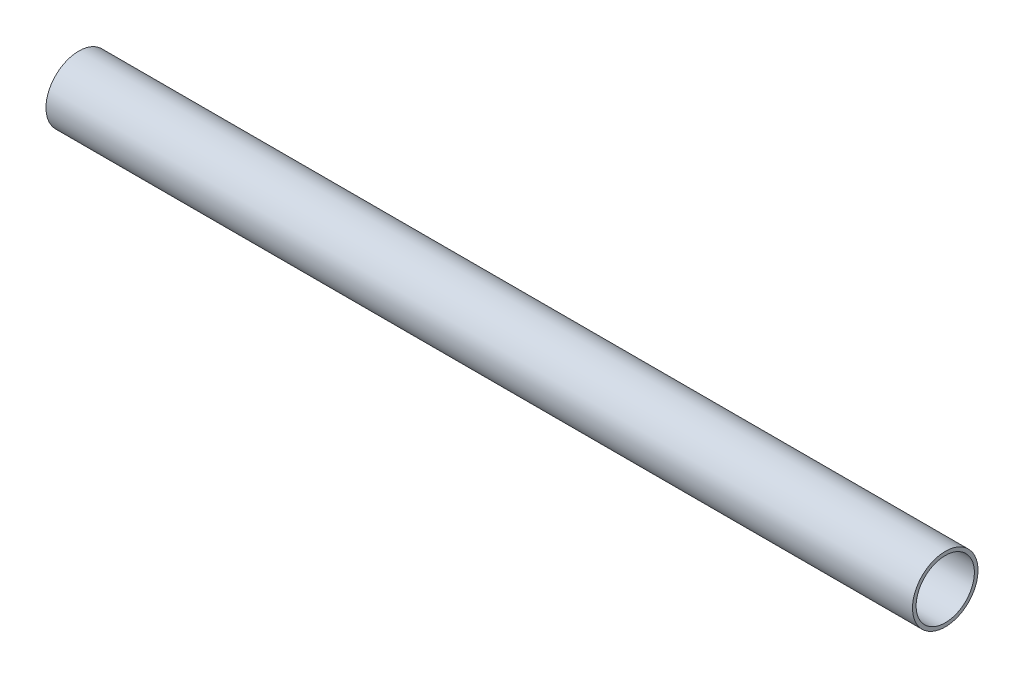
ISO-10303-21;
HEADER;
FILE_DESCRIPTION(('STEP AP214'),'2;1');
FILE_NAME('part.step','',(''),(''),'','','');
FILE_SCHEMA(('AUTOMOTIVE_DESIGN { 1 0 10303 214 1 1 1 1 }'));
ENDSEC;
DATA;
#1=APPLICATION_CONTEXT('core data for automotive mechanical design processes');
#2=APPLICATION_PROTOCOL_DEFINITION('international standard','automotive_design',2000,#1);
#3=PRODUCT_CONTEXT('',#1,'mechanical');
#4=PRODUCT('Part','Part','',(#3));
#5=PRODUCT_RELATED_PRODUCT_CATEGORY('part','',(#4));
#6=PRODUCT_DEFINITION_FORMATION('','',#4);
#7=PRODUCT_DEFINITION_CONTEXT('part definition',#1,'design');
#8=PRODUCT_DEFINITION('design','',#6,#7);
#9=PRODUCT_DEFINITION_SHAPE('','',#8);
#10=(LENGTH_UNIT() NAMED_UNIT(*) SI_UNIT(.MILLI.,.METRE.));
#11=(NAMED_UNIT(*) PLANE_ANGLE_UNIT() SI_UNIT($,.RADIAN.));
#12=(NAMED_UNIT(*) SI_UNIT($,.STERADIAN.) SOLID_ANGLE_UNIT());
#13=UNCERTAINTY_MEASURE_WITH_UNIT(LENGTH_MEASURE(1.E-05),#10,'distance_accuracy_value','');
#14=(GEOMETRIC_REPRESENTATION_CONTEXT(3) GLOBAL_UNCERTAINTY_ASSIGNED_CONTEXT((#13)) GLOBAL_UNIT_ASSIGNED_CONTEXT((#10,
#11,#12)) REPRESENTATION_CONTEXT('',''));
#15=CARTESIAN_POINT('',(0.,0.,0.));
#16=DIRECTION('',(0.,0.,1.));
#17=DIRECTION('',(1.,0.,0.));
#18=AXIS2_PLACEMENT_3D('',#15,#16,#17);
#19=CARTESIAN_POINT('',(400.183766184074,0.,0.));
#20=DIRECTION('',(-1.,0.,0.));
#21=DIRECTION('',(0.,0.,1.));
#22=AXIS2_PLACEMENT_3D('',#19,#20,#21);
#23=CYLINDRICAL_SURFACE('',#22,13.5);
#24=CARTESIAN_POINT('',(0.,0.,0.));
#25=DIRECTION('',(1.,0.,0.));
#26=DIRECTION('',(0.,0.,-1.));
#27=AXIS2_PLACEMENT_3D('',#24,#25,#26);
#28=CIRCLE('',#27,13.5);
#29=CARTESIAN_POINT('',(0.,0.,-13.5));
#30=VERTEX_POINT('',#29);
#31=EDGE_CURVE('E41',#30,#30,#28,.T.);
#32=ORIENTED_EDGE('',*,*,#31,.T.);
#33=EDGE_LOOP('',(#32));
#34=FACE_BOUND('',#33,.T.);
#35=CARTESIAN_POINT('',(357.,0.,0.));
#36=DIRECTION('',(1.,0.,0.));
#37=DIRECTION('',(0.,1.,0.));
#38=AXIS2_PLACEMENT_3D('',#35,#36,#37);
#39=CIRCLE('',#38,13.5);
#40=CARTESIAN_POINT('',(357.,13.5,0.));
#41=VERTEX_POINT('',#40);
#42=EDGE_CURVE('E11',#41,#41,#39,.T.);
#43=ORIENTED_EDGE('',*,*,#42,.F.);
#44=EDGE_LOOP('',(#43));
#45=FACE_BOUND('',#44,.T.);
#46=ADVANCED_FACE('F34',(#34,#45),#23,.T.);
#47=CARTESIAN_POINT('',(0.,0.,0.));
#48=DIRECTION('',(1.,0.,0.));
#49=DIRECTION('',(0.,0.,-1.));
#50=AXIS2_PLACEMENT_3D('',#47,#48,#49);
#51=PLANE('',#50);
#52=ORIENTED_EDGE('',*,*,#31,.F.);
#53=EDGE_LOOP('',(#52));
#54=FACE_BOUND('',#53,.T.);
#55=CARTESIAN_POINT('',(0.,0.,0.));
#56=DIRECTION('',(1.,0.,0.));
#57=DIRECTION('',(0.,0.,-1.));
#58=AXIS2_PLACEMENT_3D('',#55,#56,#57);
#59=CIRCLE('',#58,12.);
#60=CARTESIAN_POINT('',(0.,0.,-12.));
#61=VERTEX_POINT('',#60);
#62=EDGE_CURVE('E46',#61,#61,#59,.T.);
#63=ORIENTED_EDGE('',*,*,#62,.T.);
#64=EDGE_LOOP('',(#63));
#65=FACE_BOUND('',#64,.T.);
#66=ADVANCED_FACE('F62',(#54,#65),#51,.F.);
#67=CARTESIAN_POINT('',(400.183766184074,0.,0.));
#68=DIRECTION('',(-1.,0.,0.));
#69=DIRECTION('',(0.,0.,1.));
#70=AXIS2_PLACEMENT_3D('',#67,#68,#69);
#71=CYLINDRICAL_SURFACE('',#70,12.);
#72=ORIENTED_EDGE('',*,*,#62,.F.);
#73=EDGE_LOOP('',(#72));
#74=FACE_BOUND('',#73,.T.);
#75=CARTESIAN_POINT('',(357.,0.,0.));
#76=DIRECTION('',(1.,0.,0.));
#77=DIRECTION('',(0.,1.,0.));
#78=AXIS2_PLACEMENT_3D('',#75,#76,#77);
#79=CIRCLE('',#78,12.);
#80=CARTESIAN_POINT('',(357.,12.,0.));
#81=VERTEX_POINT('',#80);
#82=EDGE_CURVE('E37',#81,#81,#79,.T.);
#83=ORIENTED_EDGE('',*,*,#82,.T.);
#84=EDGE_LOOP('',(#83));
#85=FACE_BOUND('',#84,.T.);
#86=ADVANCED_FACE('F54',(#74,#85),#71,.F.);
#87=CARTESIAN_POINT('',(357.,-12.6740910566598,15.0000000000044));
#88=DIRECTION('',(1.,0.,0.));
#89=DIRECTION('',(0.,1.,0.));
#90=AXIS2_PLACEMENT_3D('',#87,#88,#89);
#91=PLANE('',#90);
#92=ORIENTED_EDGE('',*,*,#82,.F.);
#93=EDGE_LOOP('',(#92));
#94=FACE_BOUND('',#93,.T.);
#95=ORIENTED_EDGE('',*,*,#42,.T.);
#96=EDGE_LOOP('',(#95));
#97=FACE_BOUND('',#96,.T.);
#98=ADVANCED_FACE('F56',(#94,#97),#91,.T.);
#99=CLOSED_SHELL('',(#46,#66,#86,#98));
#100=MANIFOLD_SOLID_BREP('B2',#99);
#101=ADVANCED_BREP_SHAPE_REPRESENTATION('',(#18,#100),#14);
#102=SHAPE_DEFINITION_REPRESENTATION(#9,#101);
ENDSEC;
END-ISO-10303-21;
